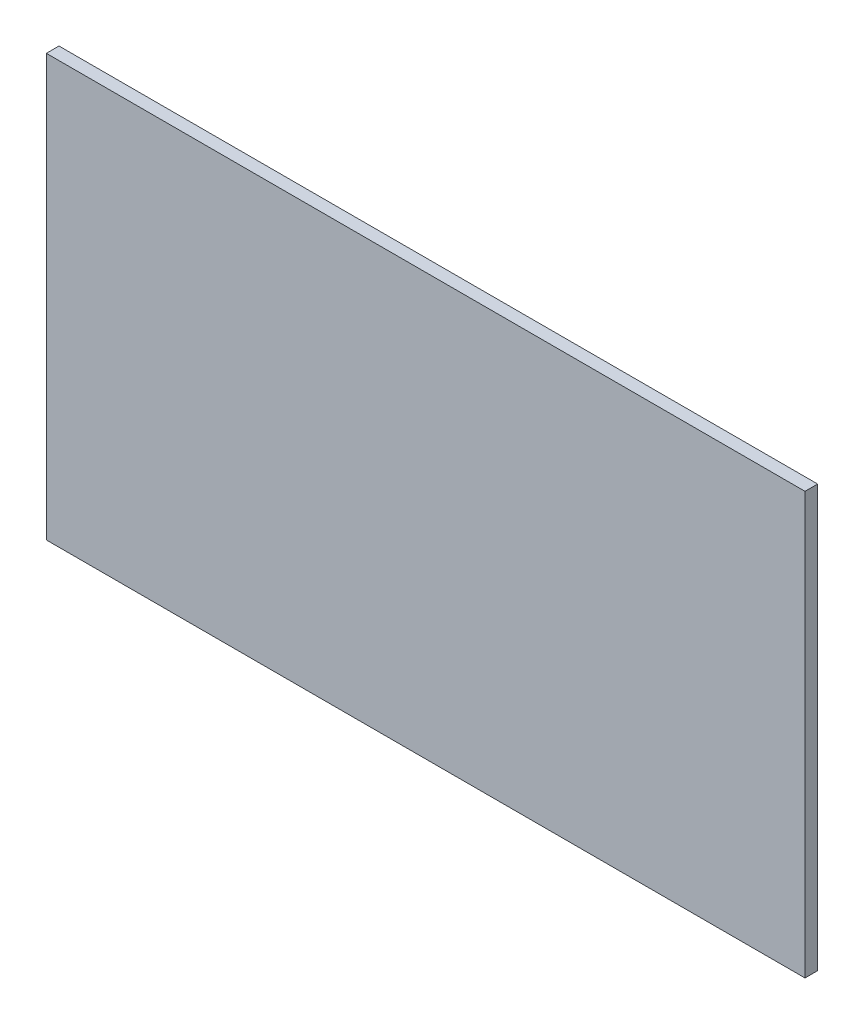
ISO-10303-21;
HEADER;
FILE_DESCRIPTION(('STEP AP214'),'2;1');
FILE_NAME('part.step','',(''),(''),'','','');
FILE_SCHEMA(('AUTOMOTIVE_DESIGN { 1 0 10303 214 1 1 1 1 }'));
ENDSEC;
DATA;
#1=APPLICATION_CONTEXT('core data for automotive mechanical design processes');
#2=APPLICATION_PROTOCOL_DEFINITION('international standard','automotive_design',2000,#1);
#3=PRODUCT_CONTEXT('',#1,'mechanical');
#4=PRODUCT('Part','Part','',(#3));
#5=PRODUCT_RELATED_PRODUCT_CATEGORY('part','',(#4));
#6=PRODUCT_DEFINITION_FORMATION('','',#4);
#7=PRODUCT_DEFINITION_CONTEXT('part definition',#1,'design');
#8=PRODUCT_DEFINITION('design','',#6,#7);
#9=PRODUCT_DEFINITION_SHAPE('','',#8);
#10=(LENGTH_UNIT() NAMED_UNIT(*) SI_UNIT(.MILLI.,.METRE.));
#11=(NAMED_UNIT(*) PLANE_ANGLE_UNIT() SI_UNIT($,.RADIAN.));
#12=(NAMED_UNIT(*) SI_UNIT($,.STERADIAN.) SOLID_ANGLE_UNIT());
#13=UNCERTAINTY_MEASURE_WITH_UNIT(LENGTH_MEASURE(1.E-05),#10,'distance_accuracy_value','');
#14=(GEOMETRIC_REPRESENTATION_CONTEXT(3) GLOBAL_UNCERTAINTY_ASSIGNED_CONTEXT((#13)) GLOBAL_UNIT_ASSIGNED_CONTEXT((#10,
#11,#12)) REPRESENTATION_CONTEXT('',''));
#15=CARTESIAN_POINT('',(0.,0.,0.));
#16=DIRECTION('',(0.,0.,1.));
#17=DIRECTION('',(1.,0.,0.));
#18=AXIS2_PLACEMENT_3D('',#15,#16,#17);
#19=CARTESIAN_POINT('',(0.,0.,3.));
#20=DIRECTION('',(1.,0.,0.));
#21=DIRECTION('',(0.,0.,-1.));
#22=AXIS2_PLACEMENT_3D('',#19,#20,#21);
#23=PLANE('',#22);
#24=DIRECTION('',(0.,-1.,0.));
#25=VECTOR('',#24,1.);
#26=CARTESIAN_POINT('',(0.,0.,0.));
#27=LINE('',#26,#25);
#28=CARTESIAN_POINT('',(0.,100.,0.));
#29=VERTEX_POINT('',#28);
#30=CARTESIAN_POINT('',(0.,0.,0.));
#31=VERTEX_POINT('',#30);
#32=EDGE_CURVE('E96',#29,#31,#27,.T.);
#33=ORIENTED_EDGE('',*,*,#32,.T.);
#34=DIRECTION('',(0.,0.,-1.));
#35=VECTOR('',#34,1.);
#36=CARTESIAN_POINT('',(0.,0.,3.));
#37=LINE('',#36,#35);
#38=CARTESIAN_POINT('',(0.,0.,3.));
#39=VERTEX_POINT('',#38);
#40=EDGE_CURVE('E11',#39,#31,#37,.T.);
#41=ORIENTED_EDGE('',*,*,#40,.F.);
#42=DIRECTION('',(0.,-1.,0.));
#43=VECTOR('',#42,1.);
#44=CARTESIAN_POINT('',(0.,0.,3.));
#45=LINE('',#44,#43);
#46=CARTESIAN_POINT('',(0.,100.,3.));
#47=VERTEX_POINT('',#46);
#48=EDGE_CURVE('E84',#47,#39,#45,.T.);
#49=ORIENTED_EDGE('',*,*,#48,.F.);
#50=DIRECTION('',(0.,0.,-1.));
#51=VECTOR('',#50,1.);
#52=CARTESIAN_POINT('',(0.,100.,3.));
#53=LINE('',#52,#51);
#54=EDGE_CURVE('E92',#47,#29,#53,.T.);
#55=ORIENTED_EDGE('',*,*,#54,.T.);
#56=EDGE_LOOP('',(#33,#41,#49,#55));
#57=FACE_BOUND('',#56,.T.);
#58=ADVANCED_FACE('F33',(#57),#23,.F.);
#59=CARTESIAN_POINT('',(0.,0.,3.));
#60=DIRECTION('',(0.,1.,0.));
#61=DIRECTION('',(0.,0.,1.));
#62=AXIS2_PLACEMENT_3D('',#59,#60,#61);
#63=PLANE('',#62);
#64=DIRECTION('',(1.,0.,0.));
#65=VECTOR('',#64,1.);
#66=CARTESIAN_POINT('',(0.,0.,0.));
#67=LINE('',#66,#65);
#68=CARTESIAN_POINT('',(180.,0.,0.));
#69=VERTEX_POINT('',#68);
#70=EDGE_CURVE('E88',#31,#69,#67,.T.);
#71=ORIENTED_EDGE('',*,*,#70,.T.);
#72=DIRECTION('',(0.,0.,-1.));
#73=VECTOR('',#72,1.);
#74=CARTESIAN_POINT('',(180.,0.,3.));
#75=LINE('',#74,#73);
#76=CARTESIAN_POINT('',(180.,0.,3.));
#77=VERTEX_POINT('',#76);
#78=EDGE_CURVE('E41',#77,#69,#75,.T.);
#79=ORIENTED_EDGE('',*,*,#78,.F.);
#80=DIRECTION('',(1.,0.,0.));
#81=VECTOR('',#80,1.);
#82=CARTESIAN_POINT('',(0.,0.,3.));
#83=LINE('',#82,#81);
#84=EDGE_CURVE('E79',#39,#77,#83,.T.);
#85=ORIENTED_EDGE('',*,*,#84,.F.);
#86=ORIENTED_EDGE('',*,*,#40,.T.);
#87=EDGE_LOOP('',(#71,#79,#85,#86));
#88=FACE_BOUND('',#87,.T.);
#89=ADVANCED_FACE('F87',(#88),#63,.F.);
#90=CARTESIAN_POINT('',(180.,0.,3.));
#91=DIRECTION('',(-1.,0.,0.));
#92=DIRECTION('',(0.,0.,1.));
#93=AXIS2_PLACEMENT_3D('',#90,#91,#92);
#94=PLANE('',#93);
#95=DIRECTION('',(0.,1.,0.));
#96=VECTOR('',#95,1.);
#97=CARTESIAN_POINT('',(180.,0.,0.));
#98=LINE('',#97,#96);
#99=CARTESIAN_POINT('',(180.,100.,0.));
#100=VERTEX_POINT('',#99);
#101=EDGE_CURVE('E66',#69,#100,#98,.T.);
#102=ORIENTED_EDGE('',*,*,#101,.T.);
#103=DIRECTION('',(0.,0.,-1.));
#104=VECTOR('',#103,1.);
#105=CARTESIAN_POINT('',(180.,100.,3.));
#106=LINE('',#105,#104);
#107=CARTESIAN_POINT('',(180.,100.,3.));
#108=VERTEX_POINT('',#107);
#109=EDGE_CURVE('E89',#108,#100,#106,.T.);
#110=ORIENTED_EDGE('',*,*,#109,.F.);
#111=DIRECTION('',(0.,1.,0.));
#112=VECTOR('',#111,1.);
#113=CARTESIAN_POINT('',(180.,0.,3.));
#114=LINE('',#113,#112);
#115=EDGE_CURVE('E82',#77,#108,#114,.T.);
#116=ORIENTED_EDGE('',*,*,#115,.F.);
#117=ORIENTED_EDGE('',*,*,#78,.T.);
#118=EDGE_LOOP('',(#102,#110,#116,#117));
#119=FACE_BOUND('',#118,.T.);
#120=ADVANCED_FACE('F90',(#119),#94,.F.);
#121=CARTESIAN_POINT('',(0.,100.,3.));
#122=DIRECTION('',(0.,-1.,0.));
#123=DIRECTION('',(0.,0.,-1.));
#124=AXIS2_PLACEMENT_3D('',#121,#122,#123);
#125=PLANE('',#124);
#126=DIRECTION('',(-1.,0.,0.));
#127=VECTOR('',#126,1.);
#128=CARTESIAN_POINT('',(0.,100.,0.));
#129=LINE('',#128,#127);
#130=EDGE_CURVE('E72',#100,#29,#129,.T.);
#131=ORIENTED_EDGE('',*,*,#130,.T.);
#132=ORIENTED_EDGE('',*,*,#54,.F.);
#133=DIRECTION('',(-1.,0.,0.));
#134=VECTOR('',#133,1.);
#135=CARTESIAN_POINT('',(0.,100.,3.));
#136=LINE('',#135,#134);
#137=EDGE_CURVE('E49',#108,#47,#136,.T.);
#138=ORIENTED_EDGE('',*,*,#137,.F.);
#139=ORIENTED_EDGE('',*,*,#109,.T.);
#140=EDGE_LOOP('',(#131,#132,#138,#139));
#141=FACE_BOUND('',#140,.T.);
#142=ADVANCED_FACE('F103',(#141),#125,.F.);
#143=CARTESIAN_POINT('',(0.,0.,3.));
#144=DIRECTION('',(0.,0.,-1.));
#145=DIRECTION('',(-1.,0.,0.));
#146=AXIS2_PLACEMENT_3D('',#143,#144,#145);
#147=PLANE('',#146);
#148=ORIENTED_EDGE('',*,*,#48,.T.);
#149=ORIENTED_EDGE('',*,*,#84,.T.);
#150=ORIENTED_EDGE('',*,*,#115,.T.);
#151=ORIENTED_EDGE('',*,*,#137,.T.);
#152=EDGE_LOOP('',(#148,#149,#150,#151));
#153=FACE_BOUND('',#152,.T.);
#154=ADVANCED_FACE('F80',(#153),#147,.F.);
#155=CARTESIAN_POINT('',(0.,0.,0.));
#156=DIRECTION('',(0.,0.,-1.));
#157=DIRECTION('',(-1.,0.,0.));
#158=AXIS2_PLACEMENT_3D('',#155,#156,#157);
#159=PLANE('',#158);
#160=ORIENTED_EDGE('',*,*,#32,.F.);
#161=ORIENTED_EDGE('',*,*,#130,.F.);
#162=ORIENTED_EDGE('',*,*,#101,.F.);
#163=ORIENTED_EDGE('',*,*,#70,.F.);
#164=EDGE_LOOP('',(#160,#161,#162,#163));
#165=FACE_BOUND('',#164,.T.);
#166=ADVANCED_FACE('F106',(#165),#159,.T.);
#167=CLOSED_SHELL('',(#58,#89,#120,#142,#154,#166));
#168=MANIFOLD_SOLID_BREP('B2',#167);
#169=ADVANCED_BREP_SHAPE_REPRESENTATION('',(#18,#168),#14);
#170=SHAPE_DEFINITION_REPRESENTATION(#9,#169);
ENDSEC;
END-ISO-10303-21;
